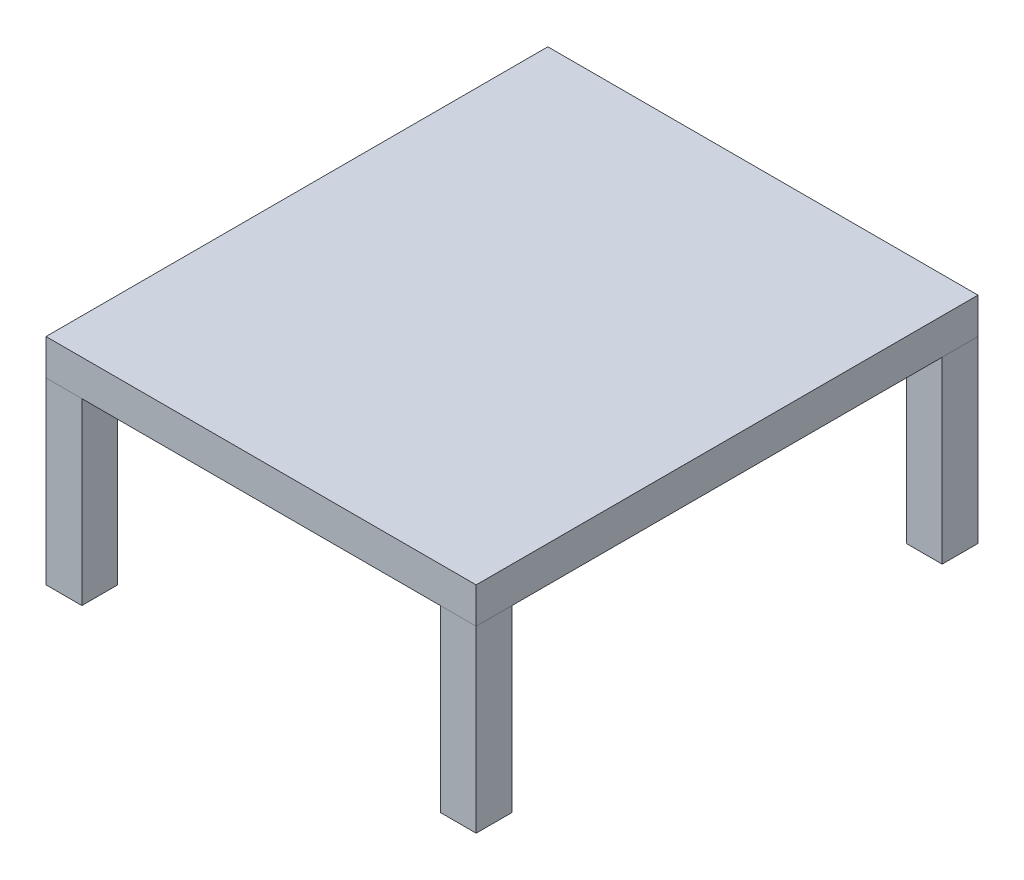
ISO-10303-21;
HEADER;
FILE_DESCRIPTION(('STEP AP214'),'2;1');
FILE_NAME('part.step','',(''),(''),'','','');
FILE_SCHEMA(('AUTOMOTIVE_DESIGN { 1 0 10303 214 1 1 1 1 }'));
ENDSEC;
DATA;
#1=APPLICATION_CONTEXT('core data for automotive mechanical design processes');
#2=APPLICATION_PROTOCOL_DEFINITION('international standard','automotive_design',2000,#1);
#3=PRODUCT_CONTEXT('',#1,'mechanical');
#4=PRODUCT('Part','Part','',(#3));
#5=PRODUCT_RELATED_PRODUCT_CATEGORY('part','',(#4));
#6=PRODUCT_DEFINITION_FORMATION('','',#4);
#7=PRODUCT_DEFINITION_CONTEXT('part definition',#1,'design');
#8=PRODUCT_DEFINITION('design','',#6,#7);
#9=PRODUCT_DEFINITION_SHAPE('','',#8);
#10=(LENGTH_UNIT() NAMED_UNIT(*) SI_UNIT(.MILLI.,.METRE.));
#11=(NAMED_UNIT(*) PLANE_ANGLE_UNIT() SI_UNIT($,.RADIAN.));
#12=(NAMED_UNIT(*) SI_UNIT($,.STERADIAN.) SOLID_ANGLE_UNIT());
#13=UNCERTAINTY_MEASURE_WITH_UNIT(LENGTH_MEASURE(1.E-05),#10,'distance_accuracy_value','');
#14=(GEOMETRIC_REPRESENTATION_CONTEXT(3) GLOBAL_UNCERTAINTY_ASSIGNED_CONTEXT((#13)) GLOBAL_UNIT_ASSIGNED_CONTEXT((#10,
#11,#12)) REPRESENTATION_CONTEXT('',''));
#15=CARTESIAN_POINT('',(0.,0.,0.));
#16=DIRECTION('',(0.,0.,1.));
#17=DIRECTION('',(1.,0.,0.));
#18=AXIS2_PLACEMENT_3D('',#15,#16,#17);
#19=CARTESIAN_POINT('',(-304.8,304.8,355.6));
#20=DIRECTION('',(1.,0.,0.));
#21=DIRECTION('',(0.,0.,-1.));
#22=AXIS2_PLACEMENT_3D('',#19,#20,#21);
#23=PLANE('',#22);
#24=DIRECTION('',(0.,0.,1.));
#25=VECTOR('',#24,1.);
#26=CARTESIAN_POINT('',(-304.8,254.,355.6));
#27=LINE('',#26,#25);
#28=CARTESIAN_POINT('',(-304.8,254.,-355.6));
#29=VERTEX_POINT('',#28);
#30=CARTESIAN_POINT('',(-304.8,254.,355.6));
#31=VERTEX_POINT('',#30);
#32=EDGE_CURVE('E111',#29,#31,#27,.T.);
#33=ORIENTED_EDGE('',*,*,#32,.T.);
#34=DIRECTION('',(0.,-1.,0.));
#35=VECTOR('',#34,1.);
#36=CARTESIAN_POINT('',(-304.8,304.8,355.6));
#37=LINE('',#36,#35);
#38=CARTESIAN_POINT('',(-304.8,304.8,355.6));
#39=VERTEX_POINT('',#38);
#40=EDGE_CURVE('E12',#39,#31,#37,.T.);
#41=ORIENTED_EDGE('',*,*,#40,.F.);
#42=DIRECTION('',(0.,0.,1.));
#43=VECTOR('',#42,1.);
#44=CARTESIAN_POINT('',(-304.8,304.8,355.6));
#45=LINE('',#44,#43);
#46=CARTESIAN_POINT('',(-304.8,304.8,-355.6));
#47=VERTEX_POINT('',#46);
#48=EDGE_CURVE('E99',#47,#39,#45,.T.);
#49=ORIENTED_EDGE('',*,*,#48,.F.);
#50=DIRECTION('',(0.,-1.,0.));
#51=VECTOR('',#50,1.);
#52=CARTESIAN_POINT('',(-304.8,304.8,-355.6));
#53=LINE('',#52,#51);
#54=EDGE_CURVE('E107',#47,#29,#53,.T.);
#55=ORIENTED_EDGE('',*,*,#54,.T.);
#56=EDGE_LOOP('',(#33,#41,#49,#55));
#57=FACE_BOUND('',#56,.T.);
#58=ADVANCED_FACE('F48',(#57),#23,.F.);
#59=CARTESIAN_POINT('',(-304.8,304.8,355.6));
#60=DIRECTION('',(0.,0.,-1.));
#61=DIRECTION('',(-1.,0.,0.));
#62=AXIS2_PLACEMENT_3D('',#59,#60,#61);
#63=PLANE('',#62);
#64=DIRECTION('',(1.,0.,0.));
#65=VECTOR('',#64,1.);
#66=CARTESIAN_POINT('',(-304.8,254.,355.6));
#67=LINE('',#66,#65);
#68=CARTESIAN_POINT('',(304.8,254.,355.6));
#69=VERTEX_POINT('',#68);
#70=EDGE_CURVE('E103',#31,#69,#67,.T.);
#71=ORIENTED_EDGE('',*,*,#70,.T.);
#72=DIRECTION('',(0.,-1.,0.));
#73=VECTOR('',#72,1.);
#74=CARTESIAN_POINT('',(304.8,304.8,355.6));
#75=LINE('',#74,#73);
#76=CARTESIAN_POINT('',(304.8,304.8,355.6));
#77=VERTEX_POINT('',#76);
#78=EDGE_CURVE('E56',#77,#69,#75,.T.);
#79=ORIENTED_EDGE('',*,*,#78,.F.);
#80=DIRECTION('',(1.,0.,0.));
#81=VECTOR('',#80,1.);
#82=CARTESIAN_POINT('',(-304.8,304.8,355.6));
#83=LINE('',#82,#81);
#84=EDGE_CURVE('E94',#39,#77,#83,.T.);
#85=ORIENTED_EDGE('',*,*,#84,.F.);
#86=ORIENTED_EDGE('',*,*,#40,.T.);
#87=EDGE_LOOP('',(#71,#79,#85,#86));
#88=FACE_BOUND('',#87,.T.);
#89=ADVANCED_FACE('F102',(#88),#63,.F.);
#90=CARTESIAN_POINT('',(304.8,304.8,355.6));
#91=DIRECTION('',(-1.,0.,0.));
#92=DIRECTION('',(0.,0.,1.));
#93=AXIS2_PLACEMENT_3D('',#90,#91,#92);
#94=PLANE('',#93);
#95=DIRECTION('',(0.,0.,-1.));
#96=VECTOR('',#95,1.);
#97=CARTESIAN_POINT('',(304.8,254.,355.6));
#98=LINE('',#97,#96);
#99=CARTESIAN_POINT('',(304.8,254.,-355.6));
#100=VERTEX_POINT('',#99);
#101=EDGE_CURVE('E81',#69,#100,#98,.T.);
#102=ORIENTED_EDGE('',*,*,#101,.T.);
#103=DIRECTION('',(0.,-1.,0.));
#104=VECTOR('',#103,1.);
#105=CARTESIAN_POINT('',(304.8,304.8,-355.6));
#106=LINE('',#105,#104);
#107=CARTESIAN_POINT('',(304.8,304.8,-355.6));
#108=VERTEX_POINT('',#107);
#109=EDGE_CURVE('E104',#108,#100,#106,.T.);
#110=ORIENTED_EDGE('',*,*,#109,.F.);
#111=DIRECTION('',(0.,0.,-1.));
#112=VECTOR('',#111,1.);
#113=CARTESIAN_POINT('',(304.8,304.8,355.6));
#114=LINE('',#113,#112);
#115=EDGE_CURVE('E97',#77,#108,#114,.T.);
#116=ORIENTED_EDGE('',*,*,#115,.F.);
#117=ORIENTED_EDGE('',*,*,#78,.T.);
#118=EDGE_LOOP('',(#102,#110,#116,#117));
#119=FACE_BOUND('',#118,.T.);
#120=ADVANCED_FACE('F105',(#119),#94,.F.);
#121=CARTESIAN_POINT('',(-304.8,304.8,-355.6));
#122=DIRECTION('',(0.,0.,1.));
#123=DIRECTION('',(1.,0.,0.));
#124=AXIS2_PLACEMENT_3D('',#121,#122,#123);
#125=PLANE('',#124);
#126=DIRECTION('',(-1.,0.,0.));
#127=VECTOR('',#126,1.);
#128=CARTESIAN_POINT('',(-304.8,254.,-355.6));
#129=LINE('',#128,#127);
#130=EDGE_CURVE('E87',#100,#29,#129,.T.);
#131=ORIENTED_EDGE('',*,*,#130,.T.);
#132=ORIENTED_EDGE('',*,*,#54,.F.);
#133=DIRECTION('',(-1.,0.,0.));
#134=VECTOR('',#133,1.);
#135=CARTESIAN_POINT('',(-304.8,304.8,-355.6));
#136=LINE('',#135,#134);
#137=EDGE_CURVE('E64',#108,#47,#136,.T.);
#138=ORIENTED_EDGE('',*,*,#137,.F.);
#139=ORIENTED_EDGE('',*,*,#109,.T.);
#140=EDGE_LOOP('',(#131,#132,#138,#139));
#141=FACE_BOUND('',#140,.T.);
#142=ADVANCED_FACE('F118',(#141),#125,.F.);
#143=CARTESIAN_POINT('',(0.,304.8,0.));
#144=DIRECTION('',(0.,-1.,0.));
#145=DIRECTION('',(0.,0.,-1.));
#146=AXIS2_PLACEMENT_3D('',#143,#144,#145);
#147=PLANE('',#146);
#148=ORIENTED_EDGE('',*,*,#48,.T.);
#149=ORIENTED_EDGE('',*,*,#84,.T.);
#150=ORIENTED_EDGE('',*,*,#115,.T.);
#151=ORIENTED_EDGE('',*,*,#137,.T.);
#152=EDGE_LOOP('',(#148,#149,#150,#151));
#153=FACE_BOUND('',#152,.T.);
#154=ADVANCED_FACE('F95',(#153),#147,.F.);
#155=CARTESIAN_POINT('',(0.,254.,0.));
#156=DIRECTION('',(0.,-1.,0.));
#157=DIRECTION('',(0.,0.,-1.));
#158=AXIS2_PLACEMENT_3D('',#155,#156,#157);
#159=PLANE('',#158);
#160=ORIENTED_EDGE('',*,*,#32,.F.);
#161=ORIENTED_EDGE('',*,*,#130,.F.);
#162=ORIENTED_EDGE('',*,*,#101,.F.);
#163=ORIENTED_EDGE('',*,*,#70,.F.);
#164=EDGE_LOOP('',(#160,#161,#162,#163));
#165=FACE_BOUND('',#164,.T.);
#166=ADVANCED_FACE('F121',(#165),#159,.T.);
#167=CLOSED_SHELL('',(#58,#89,#120,#142,#154,#166));
#168=MANIFOLD_SOLID_BREP('B2',#167);
#169=CARTESIAN_POINT('',(304.8,254.,355.6));
#170=DIRECTION('',(0.,0.,-1.));
#171=DIRECTION('',(1.,0.,0.));
#172=AXIS2_PLACEMENT_3D('',#169,#170,#171);
#173=PLANE('',#172);
#174=DIRECTION('',(-1.,0.,0.));
#175=VECTOR('',#174,1.);
#176=CARTESIAN_POINT('',(304.8,0.,355.6));
#177=LINE('',#176,#175);
#178=CARTESIAN_POINT('',(304.8,0.,355.6));
#179=VERTEX_POINT('',#178);
#180=CARTESIAN_POINT('',(254.,0.,355.6));
#181=VERTEX_POINT('',#180);
#182=EDGE_CURVE('E245',#179,#181,#177,.T.);
#183=ORIENTED_EDGE('',*,*,#182,.F.);
#184=DIRECTION('',(0.,-1.,0.));
#185=VECTOR('',#184,1.);
#186=CARTESIAN_POINT('',(304.8,254.,355.6));
#187=LINE('',#186,#185);
#188=CARTESIAN_POINT('',(304.8,254.,355.6));
#189=VERTEX_POINT('',#188);
#190=EDGE_CURVE('E244',#189,#179,#187,.T.);
#191=ORIENTED_EDGE('',*,*,#190,.F.);
#192=DIRECTION('',(-1.,0.,0.));
#193=VECTOR('',#192,1.);
#194=CARTESIAN_POINT('',(304.8,254.,355.6));
#195=LINE('',#194,#193);
#196=CARTESIAN_POINT('',(254.,254.,355.6));
#197=VERTEX_POINT('',#196);
#198=EDGE_CURVE('E239',#189,#197,#195,.T.);
#199=ORIENTED_EDGE('',*,*,#198,.T.);
#200=DIRECTION('',(0.,-1.,0.));
#201=VECTOR('',#200,1.);
#202=CARTESIAN_POINT('',(254.,254.,355.6));
#203=LINE('',#202,#201);
#204=EDGE_CURVE('E46',#197,#181,#203,.T.);
#205=ORIENTED_EDGE('',*,*,#204,.T.);
#206=EDGE_LOOP('',(#183,#191,#199,#205));
#207=FACE_BOUND('',#206,.T.);
#208=ADVANCED_FACE('F182',(#207),#173,.F.);
#209=CARTESIAN_POINT('',(254.,254.,355.6));
#210=DIRECTION('',(1.,0.,0.));
#211=DIRECTION('',(0.,0.,1.));
#212=AXIS2_PLACEMENT_3D('',#209,#210,#211);
#213=PLANE('',#212);
#214=DIRECTION('',(0.,0.,-1.));
#215=VECTOR('',#214,1.);
#216=CARTESIAN_POINT('',(254.,0.,355.6));
#217=LINE('',#216,#215);
#218=CARTESIAN_POINT('',(254.,0.,304.8));
#219=VERTEX_POINT('',#218);
#220=EDGE_CURVE('E247',#181,#219,#217,.T.);
#221=ORIENTED_EDGE('',*,*,#220,.F.);
#222=ORIENTED_EDGE('',*,*,#204,.F.);
#223=DIRECTION('',(0.,0.,-1.));
#224=VECTOR('',#223,1.);
#225=CARTESIAN_POINT('',(254.,254.,355.6));
#226=LINE('',#225,#224);
#227=CARTESIAN_POINT('',(254.,254.,304.8));
#228=VERTEX_POINT('',#227);
#229=EDGE_CURVE('E223',#197,#228,#226,.T.);
#230=ORIENTED_EDGE('',*,*,#229,.T.);
#231=DIRECTION('',(0.,-1.,0.));
#232=VECTOR('',#231,1.);
#233=CARTESIAN_POINT('',(254.,254.,304.8));
#234=LINE('',#233,#232);
#235=EDGE_CURVE('E190',#228,#219,#234,.T.);
#236=ORIENTED_EDGE('',*,*,#235,.T.);
#237=EDGE_LOOP('',(#221,#222,#230,#236));
#238=FACE_BOUND('',#237,.T.);
#239=ADVANCED_FACE('F237',(#238),#213,.F.);
#240=CARTESIAN_POINT('',(304.8,254.,304.8));
#241=DIRECTION('',(0.,0.,1.));
#242=DIRECTION('',(-1.,0.,0.));
#243=AXIS2_PLACEMENT_3D('',#240,#241,#242);
#244=PLANE('',#243);
#245=DIRECTION('',(1.,0.,0.));
#246=VECTOR('',#245,1.);
#247=CARTESIAN_POINT('',(304.8,0.,304.8));
#248=LINE('',#247,#246);
#249=CARTESIAN_POINT('',(304.8,0.,304.8));
#250=VERTEX_POINT('',#249);
#251=EDGE_CURVE('E233',#219,#250,#248,.T.);
#252=ORIENTED_EDGE('',*,*,#251,.F.);
#253=ORIENTED_EDGE('',*,*,#235,.F.);
#254=DIRECTION('',(1.,0.,0.));
#255=VECTOR('',#254,1.);
#256=CARTESIAN_POINT('',(304.8,254.,304.8));
#257=LINE('',#256,#255);
#258=CARTESIAN_POINT('',(304.8,254.,304.8));
#259=VERTEX_POINT('',#258);
#260=EDGE_CURVE('E226',#228,#259,#257,.T.);
#261=ORIENTED_EDGE('',*,*,#260,.T.);
#262=DIRECTION('',(0.,-1.,0.));
#263=VECTOR('',#262,1.);
#264=CARTESIAN_POINT('',(304.8,254.,304.8));
#265=LINE('',#264,#263);
#266=EDGE_CURVE('E236',#259,#250,#265,.T.);
#267=ORIENTED_EDGE('',*,*,#266,.T.);
#268=EDGE_LOOP('',(#252,#253,#261,#267));
#269=FACE_BOUND('',#268,.T.);
#270=ADVANCED_FACE('F232',(#269),#244,.F.);
#271=CARTESIAN_POINT('',(304.8,254.,355.6));
#272=DIRECTION('',(-1.,0.,0.));
#273=DIRECTION('',(0.,0.,-1.));
#274=AXIS2_PLACEMENT_3D('',#271,#272,#273);
#275=PLANE('',#274);
#276=DIRECTION('',(0.,0.,1.));
#277=VECTOR('',#276,1.);
#278=CARTESIAN_POINT('',(304.8,0.,355.6));
#279=LINE('',#278,#277);
#280=EDGE_CURVE('E212',#250,#179,#279,.T.);
#281=ORIENTED_EDGE('',*,*,#280,.F.);
#282=ORIENTED_EDGE('',*,*,#266,.F.);
#283=DIRECTION('',(0.,0.,1.));
#284=VECTOR('',#283,1.);
#285=CARTESIAN_POINT('',(304.8,254.,355.6));
#286=LINE('',#285,#284);
#287=EDGE_CURVE('E198',#259,#189,#286,.T.);
#288=ORIENTED_EDGE('',*,*,#287,.T.);
#289=ORIENTED_EDGE('',*,*,#190,.T.);
#290=EDGE_LOOP('',(#281,#282,#288,#289));
#291=FACE_BOUND('',#290,.T.);
#292=ADVANCED_FACE('F256',(#291),#275,.F.);
#293=CARTESIAN_POINT('',(0.,254.,0.));
#294=DIRECTION('',(0.,1.,0.));
#295=DIRECTION('',(0.,0.,1.));
#296=AXIS2_PLACEMENT_3D('',#293,#294,#295);
#297=PLANE('',#296);
#298=ORIENTED_EDGE('',*,*,#198,.F.);
#299=ORIENTED_EDGE('',*,*,#287,.F.);
#300=ORIENTED_EDGE('',*,*,#260,.F.);
#301=ORIENTED_EDGE('',*,*,#229,.F.);
#302=EDGE_LOOP('',(#298,#299,#300,#301));
#303=FACE_BOUND('',#302,.T.);
#304=ADVANCED_FACE('F228',(#303),#297,.T.);
#305=CARTESIAN_POINT('',(0.,0.,0.));
#306=DIRECTION('',(0.,1.,0.));
#307=DIRECTION('',(0.,0.,1.));
#308=AXIS2_PLACEMENT_3D('',#305,#306,#307);
#309=PLANE('',#308);
#310=ORIENTED_EDGE('',*,*,#182,.T.);
#311=ORIENTED_EDGE('',*,*,#220,.T.);
#312=ORIENTED_EDGE('',*,*,#251,.T.);
#313=ORIENTED_EDGE('',*,*,#280,.T.);
#314=EDGE_LOOP('',(#310,#311,#312,#313));
#315=FACE_BOUND('',#314,.T.);
#316=ADVANCED_FACE('F252',(#315),#309,.F.);
#317=CLOSED_SHELL('',(#208,#239,#270,#292,#304,#316));
#318=MANIFOLD_SOLID_BREP('B6',#317);
#319=CARTESIAN_POINT('',(304.8,254.,-355.6));
#320=DIRECTION('',(-1.,0.,0.));
#321=DIRECTION('',(0.,0.,-1.));
#322=AXIS2_PLACEMENT_3D('',#319,#320,#321);
#323=PLANE('',#322);
#324=DIRECTION('',(0.,0.,1.));
#325=VECTOR('',#324,1.);
#326=CARTESIAN_POINT('',(304.8,0.,-355.6));
#327=LINE('',#326,#325);
#328=CARTESIAN_POINT('',(304.8,0.,-355.6));
#329=VERTEX_POINT('',#328);
#330=CARTESIAN_POINT('',(304.8,0.,-304.8));
#331=VERTEX_POINT('',#330);
#332=EDGE_CURVE('E379',#329,#331,#327,.T.);
#333=ORIENTED_EDGE('',*,*,#332,.F.);
#334=DIRECTION('',(0.,-1.,0.));
#335=VECTOR('',#334,1.);
#336=CARTESIAN_POINT('',(304.8,254.,-355.6));
#337=LINE('',#336,#335);
#338=CARTESIAN_POINT('',(304.8,254.,-355.6));
#339=VERTEX_POINT('',#338);
#340=EDGE_CURVE('E378',#339,#329,#337,.T.);
#341=ORIENTED_EDGE('',*,*,#340,.F.);
#342=DIRECTION('',(0.,0.,1.));
#343=VECTOR('',#342,1.);
#344=CARTESIAN_POINT('',(304.8,254.,-355.6));
#345=LINE('',#344,#343);
#346=CARTESIAN_POINT('',(304.8,254.,-304.8));
#347=VERTEX_POINT('',#346);
#348=EDGE_CURVE('E373',#339,#347,#345,.T.);
#349=ORIENTED_EDGE('',*,*,#348,.T.);
#350=DIRECTION('',(0.,-1.,0.));
#351=VECTOR('',#350,1.);
#352=CARTESIAN_POINT('',(304.8,254.,-304.8));
#353=LINE('',#352,#351);
#354=EDGE_CURVE('E180',#347,#331,#353,.T.);
#355=ORIENTED_EDGE('',*,*,#354,.T.);
#356=EDGE_LOOP('',(#333,#341,#349,#355));
#357=FACE_BOUND('',#356,.T.);
#358=ADVANCED_FACE('F316',(#357),#323,.F.);
#359=CARTESIAN_POINT('',(304.8,254.,-304.8));
#360=DIRECTION('',(0.,0.,-1.));
#361=DIRECTION('',(1.,0.,0.));
#362=AXIS2_PLACEMENT_3D('',#359,#360,#361);
#363=PLANE('',#362);
#364=DIRECTION('',(-1.,0.,0.));
#365=VECTOR('',#364,1.);
#366=CARTESIAN_POINT('',(304.8,0.,-304.8));
#367=LINE('',#366,#365);
#368=CARTESIAN_POINT('',(254.,0.,-304.8));
#369=VERTEX_POINT('',#368);
#370=EDGE_CURVE('E381',#331,#369,#367,.T.);
#371=ORIENTED_EDGE('',*,*,#370,.F.);
#372=ORIENTED_EDGE('',*,*,#354,.F.);
#373=DIRECTION('',(-1.,0.,0.));
#374=VECTOR('',#373,1.);
#375=CARTESIAN_POINT('',(304.8,254.,-304.8));
#376=LINE('',#375,#374);
#377=CARTESIAN_POINT('',(254.,254.,-304.8));
#378=VERTEX_POINT('',#377);
#379=EDGE_CURVE('E357',#347,#378,#376,.T.);
#380=ORIENTED_EDGE('',*,*,#379,.T.);
#381=DIRECTION('',(0.,-1.,0.));
#382=VECTOR('',#381,1.);
#383=CARTESIAN_POINT('',(254.,254.,-304.8));
#384=LINE('',#383,#382);
#385=EDGE_CURVE('E324',#378,#369,#384,.T.);
#386=ORIENTED_EDGE('',*,*,#385,.T.);
#387=EDGE_LOOP('',(#371,#372,#380,#386));
#388=FACE_BOUND('',#387,.T.);
#389=ADVANCED_FACE('F371',(#388),#363,.F.);
#390=CARTESIAN_POINT('',(254.,254.,-355.6));
#391=DIRECTION('',(1.,0.,0.));
#392=DIRECTION('',(0.,0.,1.));
#393=AXIS2_PLACEMENT_3D('',#390,#391,#392);
#394=PLANE('',#393);
#395=DIRECTION('',(0.,0.,-1.));
#396=VECTOR('',#395,1.);
#397=CARTESIAN_POINT('',(254.,0.,-355.6));
#398=LINE('',#397,#396);
#399=CARTESIAN_POINT('',(254.,0.,-355.6));
#400=VERTEX_POINT('',#399);
#401=EDGE_CURVE('E367',#369,#400,#398,.T.);
#402=ORIENTED_EDGE('',*,*,#401,.F.);
#403=ORIENTED_EDGE('',*,*,#385,.F.);
#404=DIRECTION('',(0.,0.,-1.));
#405=VECTOR('',#404,1.);
#406=CARTESIAN_POINT('',(254.,254.,-355.6));
#407=LINE('',#406,#405);
#408=CARTESIAN_POINT('',(254.,254.,-355.6));
#409=VERTEX_POINT('',#408);
#410=EDGE_CURVE('E360',#378,#409,#407,.T.);
#411=ORIENTED_EDGE('',*,*,#410,.T.);
#412=DIRECTION('',(0.,-1.,0.));
#413=VECTOR('',#412,1.);
#414=CARTESIAN_POINT('',(254.,254.,-355.6));
#415=LINE('',#414,#413);
#416=EDGE_CURVE('E370',#409,#400,#415,.T.);
#417=ORIENTED_EDGE('',*,*,#416,.T.);
#418=EDGE_LOOP('',(#402,#403,#411,#417));
#419=FACE_BOUND('',#418,.T.);
#420=ADVANCED_FACE('F366',(#419),#394,.F.);
#421=CARTESIAN_POINT('',(304.8,254.,-355.6));
#422=DIRECTION('',(0.,0.,1.));
#423=DIRECTION('',(-1.,0.,0.));
#424=AXIS2_PLACEMENT_3D('',#421,#422,#423);
#425=PLANE('',#424);
#426=DIRECTION('',(1.,0.,0.));
#427=VECTOR('',#426,1.);
#428=CARTESIAN_POINT('',(304.8,0.,-355.6));
#429=LINE('',#428,#427);
#430=EDGE_CURVE('E346',#400,#329,#429,.T.);
#431=ORIENTED_EDGE('',*,*,#430,.F.);
#432=ORIENTED_EDGE('',*,*,#416,.F.);
#433=DIRECTION('',(1.,0.,0.));
#434=VECTOR('',#433,1.);
#435=CARTESIAN_POINT('',(304.8,254.,-355.6));
#436=LINE('',#435,#434);
#437=EDGE_CURVE('E332',#409,#339,#436,.T.);
#438=ORIENTED_EDGE('',*,*,#437,.T.);
#439=ORIENTED_EDGE('',*,*,#340,.T.);
#440=EDGE_LOOP('',(#431,#432,#438,#439));
#441=FACE_BOUND('',#440,.T.);
#442=ADVANCED_FACE('F390',(#441),#425,.F.);
#443=CARTESIAN_POINT('',(0.,254.,0.));
#444=DIRECTION('',(0.,1.,0.));
#445=DIRECTION('',(0.,0.,1.));
#446=AXIS2_PLACEMENT_3D('',#443,#444,#445);
#447=PLANE('',#446);
#448=ORIENTED_EDGE('',*,*,#348,.F.);
#449=ORIENTED_EDGE('',*,*,#437,.F.);
#450=ORIENTED_EDGE('',*,*,#410,.F.);
#451=ORIENTED_EDGE('',*,*,#379,.F.);
#452=EDGE_LOOP('',(#448,#449,#450,#451));
#453=FACE_BOUND('',#452,.T.);
#454=ADVANCED_FACE('F362',(#453),#447,.T.);
#455=CARTESIAN_POINT('',(0.,0.,0.));
#456=DIRECTION('',(0.,1.,0.));
#457=DIRECTION('',(0.,0.,1.));
#458=AXIS2_PLACEMENT_3D('',#455,#456,#457);
#459=PLANE('',#458);
#460=ORIENTED_EDGE('',*,*,#332,.T.);
#461=ORIENTED_EDGE('',*,*,#370,.T.);
#462=ORIENTED_EDGE('',*,*,#401,.T.);
#463=ORIENTED_EDGE('',*,*,#430,.T.);
#464=EDGE_LOOP('',(#460,#461,#462,#463));
#465=FACE_BOUND('',#464,.T.);
#466=ADVANCED_FACE('F386',(#465),#459,.F.);
#467=CLOSED_SHELL('',(#358,#389,#420,#442,#454,#466));
#468=MANIFOLD_SOLID_BREP('B40',#467);
#469=CARTESIAN_POINT('',(-304.8,254.,355.6));
#470=DIRECTION('',(0.,0.,-1.));
#471=DIRECTION('',(-1.,0.,0.));
#472=AXIS2_PLACEMENT_3D('',#469,#470,#471);
#473=PLANE('',#472);
#474=DIRECTION('',(1.,0.,0.));
#475=VECTOR('',#474,1.);
#476=CARTESIAN_POINT('',(-304.8,0.,355.6));
#477=LINE('',#476,#475);
#478=CARTESIAN_POINT('',(-304.8,0.,355.6));
#479=VERTEX_POINT('',#478);
#480=CARTESIAN_POINT('',(-254.,0.,355.6));
#481=VERTEX_POINT('',#480);
#482=EDGE_CURVE('E512',#479,#481,#477,.T.);
#483=ORIENTED_EDGE('',*,*,#482,.T.);
#484=DIRECTION('',(0.,-1.,0.));
#485=VECTOR('',#484,1.);
#486=CARTESIAN_POINT('',(-254.,254.,355.6));
#487=LINE('',#486,#485);
#488=CARTESIAN_POINT('',(-254.,254.,355.6));
#489=VERTEX_POINT('',#488);
#490=EDGE_CURVE('E314',#489,#481,#487,.T.);
#491=ORIENTED_EDGE('',*,*,#490,.F.);
#492=DIRECTION('',(1.,0.,0.));
#493=VECTOR('',#492,1.);
#494=CARTESIAN_POINT('',(-304.8,254.,355.6));
#495=LINE('',#494,#493);
#496=CARTESIAN_POINT('',(-304.8,254.,355.6));
#497=VERTEX_POINT('',#496);
#498=EDGE_CURVE('E500',#497,#489,#495,.T.);
#499=ORIENTED_EDGE('',*,*,#498,.F.);
#500=DIRECTION('',(0.,-1.,0.));
#501=VECTOR('',#500,1.);
#502=CARTESIAN_POINT('',(-304.8,254.,355.6));
#503=LINE('',#502,#501);
#504=EDGE_CURVE('E508',#497,#479,#503,.T.);
#505=ORIENTED_EDGE('',*,*,#504,.T.);
#506=EDGE_LOOP('',(#483,#491,#499,#505));
#507=FACE_BOUND('',#506,.T.);
#508=ADVANCED_FACE('F449',(#507),#473,.F.);
#509=CARTESIAN_POINT('',(-254.,254.,355.6));
#510=DIRECTION('',(-1.,0.,0.));
#511=DIRECTION('',(0.,0.,1.));
#512=AXIS2_PLACEMENT_3D('',#509,#510,#511);
#513=PLANE('',#512);
#514=DIRECTION('',(0.,0.,-1.));
#515=VECTOR('',#514,1.);
#516=CARTESIAN_POINT('',(-254.,0.,355.6));
#517=LINE('',#516,#515);
#518=CARTESIAN_POINT('',(-254.,0.,304.8));
#519=VERTEX_POINT('',#518);
#520=EDGE_CURVE('E504',#481,#519,#517,.T.);
#521=ORIENTED_EDGE('',*,*,#520,.T.);
#522=DIRECTION('',(0.,-1.,0.));
#523=VECTOR('',#522,1.);
#524=CARTESIAN_POINT('',(-254.,254.,304.8));
#525=LINE('',#524,#523);
#526=CARTESIAN_POINT('',(-254.,254.,304.8));
#527=VERTEX_POINT('',#526);
#528=EDGE_CURVE('E457',#527,#519,#525,.T.);
#529=ORIENTED_EDGE('',*,*,#528,.F.);
#530=DIRECTION('',(0.,0.,-1.));
#531=VECTOR('',#530,1.);
#532=CARTESIAN_POINT('',(-254.,254.,355.6));
#533=LINE('',#532,#531);
#534=EDGE_CURVE('E495',#489,#527,#533,.T.);
#535=ORIENTED_EDGE('',*,*,#534,.F.);
#536=ORIENTED_EDGE('',*,*,#490,.T.);
#537=EDGE_LOOP('',(#521,#529,#535,#536));
#538=FACE_BOUND('',#537,.T.);
#539=ADVANCED_FACE('F503',(#538),#513,.F.);
#540=CARTESIAN_POINT('',(-304.8,254.,304.8));
#541=DIRECTION('',(0.,0.,1.));
#542=DIRECTION('',(1.,0.,0.));
#543=AXIS2_PLACEMENT_3D('',#540,#541,#542);
#544=PLANE('',#543);
#545=DIRECTION('',(-1.,0.,0.));
#546=VECTOR('',#545,1.);
#547=CARTESIAN_POINT('',(-304.8,0.,304.8));
#548=LINE('',#547,#546);
#549=CARTESIAN_POINT('',(-304.8,0.,304.8));
#550=VERTEX_POINT('',#549);
#551=EDGE_CURVE('E482',#519,#550,#548,.T.);
#552=ORIENTED_EDGE('',*,*,#551,.T.);
#553=DIRECTION('',(0.,-1.,0.));
#554=VECTOR('',#553,1.);
#555=CARTESIAN_POINT('',(-304.8,254.,304.8));
#556=LINE('',#555,#554);
#557=CARTESIAN_POINT('',(-304.8,254.,304.8));
#558=VERTEX_POINT('',#557);
#559=EDGE_CURVE('E505',#558,#550,#556,.T.);
#560=ORIENTED_EDGE('',*,*,#559,.F.);
#561=DIRECTION('',(-1.,0.,0.));
#562=VECTOR('',#561,1.);
#563=CARTESIAN_POINT('',(-304.8,254.,304.8));
#564=LINE('',#563,#562);
#565=EDGE_CURVE('E498',#527,#558,#564,.T.);
#566=ORIENTED_EDGE('',*,*,#565,.F.);
#567=ORIENTED_EDGE('',*,*,#528,.T.);
#568=EDGE_LOOP('',(#552,#560,#566,#567));
#569=FACE_BOUND('',#568,.T.);
#570=ADVANCED_FACE('F506',(#569),#544,.F.);
#571=CARTESIAN_POINT('',(-304.8,254.,355.6));
#572=DIRECTION('',(1.,0.,0.));
#573=DIRECTION('',(0.,0.,-1.));
#574=AXIS2_PLACEMENT_3D('',#571,#572,#573);
#575=PLANE('',#574);
#576=DIRECTION('',(0.,0.,1.));
#577=VECTOR('',#576,1.);
#578=CARTESIAN_POINT('',(-304.8,0.,355.6));
#579=LINE('',#578,#577);
#580=EDGE_CURVE('E488',#550,#479,#579,.T.);
#581=ORIENTED_EDGE('',*,*,#580,.T.);
#582=ORIENTED_EDGE('',*,*,#504,.F.);
#583=DIRECTION('',(0.,0.,1.));
#584=VECTOR('',#583,1.);
#585=CARTESIAN_POINT('',(-304.8,254.,355.6));
#586=LINE('',#585,#584);
#587=EDGE_CURVE('E465',#558,#497,#586,.T.);
#588=ORIENTED_EDGE('',*,*,#587,.F.);
#589=ORIENTED_EDGE('',*,*,#559,.T.);
#590=EDGE_LOOP('',(#581,#582,#588,#589));
#591=FACE_BOUND('',#590,.T.);
#592=ADVANCED_FACE('F519',(#591),#575,.F.);
#593=CARTESIAN_POINT('',(0.,254.,0.));
#594=DIRECTION('',(0.,1.,0.));
#595=DIRECTION('',(0.,0.,1.));
#596=AXIS2_PLACEMENT_3D('',#593,#594,#595);
#597=PLANE('',#596);
#598=ORIENTED_EDGE('',*,*,#498,.T.);
#599=ORIENTED_EDGE('',*,*,#534,.T.);
#600=ORIENTED_EDGE('',*,*,#565,.T.);
#601=ORIENTED_EDGE('',*,*,#587,.T.);
#602=EDGE_LOOP('',(#598,#599,#600,#601));
#603=FACE_BOUND('',#602,.T.);
#604=ADVANCED_FACE('F496',(#603),#597,.T.);
#605=CARTESIAN_POINT('',(0.,0.,0.));
#606=DIRECTION('',(0.,1.,0.));
#607=DIRECTION('',(0.,0.,1.));
#608=AXIS2_PLACEMENT_3D('',#605,#606,#607);
#609=PLANE('',#608);
#610=ORIENTED_EDGE('',*,*,#482,.F.);
#611=ORIENTED_EDGE('',*,*,#580,.F.);
#612=ORIENTED_EDGE('',*,*,#551,.F.);
#613=ORIENTED_EDGE('',*,*,#520,.F.);
#614=EDGE_LOOP('',(#610,#611,#612,#613));
#615=FACE_BOUND('',#614,.T.);
#616=ADVANCED_FACE('F522',(#615),#609,.F.);
#617=CLOSED_SHELL('',(#508,#539,#570,#592,#604,#616));
#618=MANIFOLD_SOLID_BREP('B174',#617);
#619=CARTESIAN_POINT('',(-304.8,254.,-355.6));
#620=DIRECTION('',(1.,0.,0.));
#621=DIRECTION('',(0.,0.,-1.));
#622=AXIS2_PLACEMENT_3D('',#619,#620,#621);
#623=PLANE('',#622);
#624=DIRECTION('',(0.,0.,1.));
#625=VECTOR('',#624,1.);
#626=CARTESIAN_POINT('',(-304.8,0.,-355.6));
#627=LINE('',#626,#625);
#628=CARTESIAN_POINT('',(-304.8,0.,-355.6));
#629=VERTEX_POINT('',#628);
#630=CARTESIAN_POINT('',(-304.8,0.,-304.8));
#631=VERTEX_POINT('',#630);
#632=EDGE_CURVE('E636',#629,#631,#627,.T.);
#633=ORIENTED_EDGE('',*,*,#632,.T.);
#634=DIRECTION('',(0.,-1.,0.));
#635=VECTOR('',#634,1.);
#636=CARTESIAN_POINT('',(-304.8,254.,-304.8));
#637=LINE('',#636,#635);
#638=CARTESIAN_POINT('',(-304.8,254.,-304.8));
#639=VERTEX_POINT('',#638);
#640=EDGE_CURVE('E447',#639,#631,#637,.T.);
#641=ORIENTED_EDGE('',*,*,#640,.F.);
#642=DIRECTION('',(0.,0.,1.));
#643=VECTOR('',#642,1.);
#644=CARTESIAN_POINT('',(-304.8,254.,-355.6));
#645=LINE('',#644,#643);
#646=CARTESIAN_POINT('',(-304.8,254.,-355.6));
#647=VERTEX_POINT('',#646);
#648=EDGE_CURVE('E624',#647,#639,#645,.T.);
#649=ORIENTED_EDGE('',*,*,#648,.F.);
#650=DIRECTION('',(0.,-1.,0.));
#651=VECTOR('',#650,1.);
#652=CARTESIAN_POINT('',(-304.8,254.,-355.6));
#653=LINE('',#652,#651);
#654=EDGE_CURVE('E632',#647,#629,#653,.T.);
#655=ORIENTED_EDGE('',*,*,#654,.T.);
#656=EDGE_LOOP('',(#633,#641,#649,#655));
#657=FACE_BOUND('',#656,.T.);
#658=ADVANCED_FACE('F573',(#657),#623,.F.);
#659=CARTESIAN_POINT('',(-304.8,254.,-304.8));
#660=DIRECTION('',(0.,0.,-1.));
#661=DIRECTION('',(-1.,0.,0.));
#662=AXIS2_PLACEMENT_3D('',#659,#660,#661);
#663=PLANE('',#662);
#664=DIRECTION('',(1.,0.,0.));
#665=VECTOR('',#664,1.);
#666=CARTESIAN_POINT('',(-304.8,0.,-304.8));
#667=LINE('',#666,#665);
#668=CARTESIAN_POINT('',(-254.,0.,-304.8));
#669=VERTEX_POINT('',#668);
#670=EDGE_CURVE('E628',#631,#669,#667,.T.);
#671=ORIENTED_EDGE('',*,*,#670,.T.);
#672=DIRECTION('',(0.,-1.,0.));
#673=VECTOR('',#672,1.);
#674=CARTESIAN_POINT('',(-254.,254.,-304.8));
#675=LINE('',#674,#673);
#676=CARTESIAN_POINT('',(-254.,254.,-304.8));
#677=VERTEX_POINT('',#676);
#678=EDGE_CURVE('E581',#677,#669,#675,.T.);
#679=ORIENTED_EDGE('',*,*,#678,.F.);
#680=DIRECTION('',(1.,0.,0.));
#681=VECTOR('',#680,1.);
#682=CARTESIAN_POINT('',(-304.8,254.,-304.8));
#683=LINE('',#682,#681);
#684=EDGE_CURVE('E619',#639,#677,#683,.T.);
#685=ORIENTED_EDGE('',*,*,#684,.F.);
#686=ORIENTED_EDGE('',*,*,#640,.T.);
#687=EDGE_LOOP('',(#671,#679,#685,#686));
#688=FACE_BOUND('',#687,.T.);
#689=ADVANCED_FACE('F627',(#688),#663,.F.);
#690=CARTESIAN_POINT('',(-254.,254.,-355.6));
#691=DIRECTION('',(-1.,0.,0.));
#692=DIRECTION('',(0.,0.,1.));
#693=AXIS2_PLACEMENT_3D('',#690,#691,#692);
#694=PLANE('',#693);
#695=DIRECTION('',(0.,0.,-1.));
#696=VECTOR('',#695,1.);
#697=CARTESIAN_POINT('',(-254.,0.,-355.6));
#698=LINE('',#697,#696);
#699=CARTESIAN_POINT('',(-254.,0.,-355.6));
#700=VERTEX_POINT('',#699);
#701=EDGE_CURVE('E606',#669,#700,#698,.T.);
#702=ORIENTED_EDGE('',*,*,#701,.T.);
#703=DIRECTION('',(0.,-1.,0.));
#704=VECTOR('',#703,1.);
#705=CARTESIAN_POINT('',(-254.,254.,-355.6));
#706=LINE('',#705,#704);
#707=CARTESIAN_POINT('',(-254.,254.,-355.6));
#708=VERTEX_POINT('',#707);
#709=EDGE_CURVE('E629',#708,#700,#706,.T.);
#710=ORIENTED_EDGE('',*,*,#709,.F.);
#711=DIRECTION('',(0.,0.,-1.));
#712=VECTOR('',#711,1.);
#713=CARTESIAN_POINT('',(-254.,254.,-355.6));
#714=LINE('',#713,#712);
#715=EDGE_CURVE('E622',#677,#708,#714,.T.);
#716=ORIENTED_EDGE('',*,*,#715,.F.);
#717=ORIENTED_EDGE('',*,*,#678,.T.);
#718=EDGE_LOOP('',(#702,#710,#716,#717));
#719=FACE_BOUND('',#718,.T.);
#720=ADVANCED_FACE('F630',(#719),#694,.F.);
#721=CARTESIAN_POINT('',(-304.8,254.,-355.6));
#722=DIRECTION('',(0.,0.,1.));
#723=DIRECTION('',(1.,0.,0.));
#724=AXIS2_PLACEMENT_3D('',#721,#722,#723);
#725=PLANE('',#724);
#726=DIRECTION('',(-1.,0.,0.));
#727=VECTOR('',#726,1.);
#728=CARTESIAN_POINT('',(-304.8,0.,-355.6));
#729=LINE('',#728,#727);
#730=EDGE_CURVE('E612',#700,#629,#729,.T.);
#731=ORIENTED_EDGE('',*,*,#730,.T.);
#732=ORIENTED_EDGE('',*,*,#654,.F.);
#733=DIRECTION('',(-1.,0.,0.));
#734=VECTOR('',#733,1.);
#735=CARTESIAN_POINT('',(-304.8,254.,-355.6));
#736=LINE('',#735,#734);
#737=EDGE_CURVE('E589',#708,#647,#736,.T.);
#738=ORIENTED_EDGE('',*,*,#737,.F.);
#739=ORIENTED_EDGE('',*,*,#709,.T.);
#740=EDGE_LOOP('',(#731,#732,#738,#739));
#741=FACE_BOUND('',#740,.T.);
#742=ADVANCED_FACE('F643',(#741),#725,.F.);
#743=CARTESIAN_POINT('',(0.,254.,0.));
#744=DIRECTION('',(0.,1.,0.));
#745=DIRECTION('',(0.,0.,1.));
#746=AXIS2_PLACEMENT_3D('',#743,#744,#745);
#747=PLANE('',#746);
#748=ORIENTED_EDGE('',*,*,#648,.T.);
#749=ORIENTED_EDGE('',*,*,#684,.T.);
#750=ORIENTED_EDGE('',*,*,#715,.T.);
#751=ORIENTED_EDGE('',*,*,#737,.T.);
#752=EDGE_LOOP('',(#748,#749,#750,#751));
#753=FACE_BOUND('',#752,.T.);
#754=ADVANCED_FACE('F620',(#753),#747,.T.);
#755=CARTESIAN_POINT('',(0.,0.,0.));
#756=DIRECTION('',(0.,1.,0.));
#757=DIRECTION('',(0.,0.,1.));
#758=AXIS2_PLACEMENT_3D('',#755,#756,#757);
#759=PLANE('',#758);
#760=ORIENTED_EDGE('',*,*,#632,.F.);
#761=ORIENTED_EDGE('',*,*,#730,.F.);
#762=ORIENTED_EDGE('',*,*,#701,.F.);
#763=ORIENTED_EDGE('',*,*,#670,.F.);
#764=EDGE_LOOP('',(#760,#761,#762,#763));
#765=FACE_BOUND('',#764,.T.);
#766=ADVANCED_FACE('F646',(#765),#759,.F.);
#767=CLOSED_SHELL('',(#658,#689,#720,#742,#754,#766));
#768=MANIFOLD_SOLID_BREP('B308',#767);
#769=ADVANCED_BREP_SHAPE_REPRESENTATION('',(#18,#168,#318,#468,#618,#768),#14);
#770=SHAPE_DEFINITION_REPRESENTATION(#9,#769);
ENDSEC;
END-ISO-10303-21;
